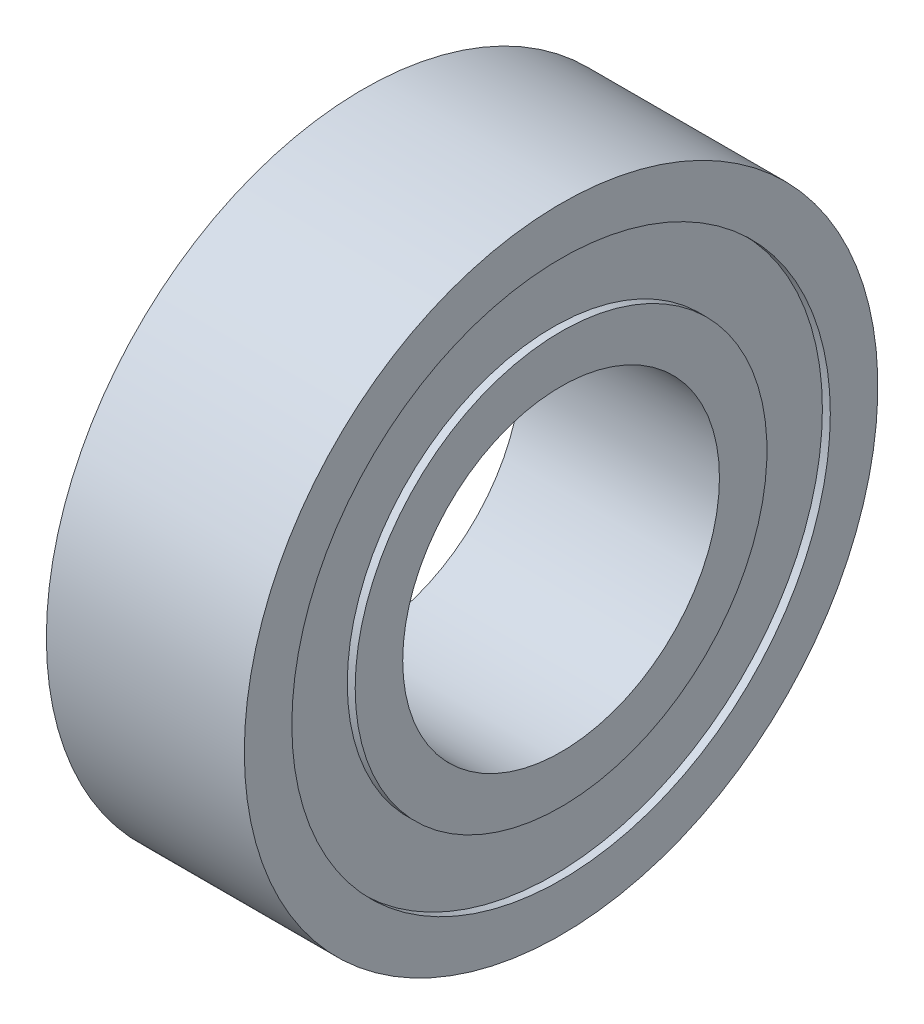
ISO-10303-21;
HEADER;
FILE_DESCRIPTION(('STEP AP214'),'2;1');
FILE_NAME('part.step','',(''),(''),'','','');
FILE_SCHEMA(('AUTOMOTIVE_DESIGN { 1 0 10303 214 1 1 1 1 }'));
ENDSEC;
DATA;
#1=APPLICATION_CONTEXT('core data for automotive mechanical design processes');
#2=APPLICATION_PROTOCOL_DEFINITION('international standard','automotive_design',2000,#1);
#3=PRODUCT_CONTEXT('',#1,'mechanical');
#4=PRODUCT('Part','Part','',(#3));
#5=PRODUCT_RELATED_PRODUCT_CATEGORY('part','',(#4));
#6=PRODUCT_DEFINITION_FORMATION('','',#4);
#7=PRODUCT_DEFINITION_CONTEXT('part definition',#1,'design');
#8=PRODUCT_DEFINITION('design','',#6,#7);
#9=PRODUCT_DEFINITION_SHAPE('','',#8);
#10=(LENGTH_UNIT() NAMED_UNIT(*) SI_UNIT(.MILLI.,.METRE.));
#11=(NAMED_UNIT(*) PLANE_ANGLE_UNIT() SI_UNIT($,.RADIAN.));
#12=(NAMED_UNIT(*) SI_UNIT($,.STERADIAN.) SOLID_ANGLE_UNIT());
#13=UNCERTAINTY_MEASURE_WITH_UNIT(LENGTH_MEASURE(1.E-05),#10,'distance_accuracy_value','');
#14=(GEOMETRIC_REPRESENTATION_CONTEXT(3) GLOBAL_UNCERTAINTY_ASSIGNED_CONTEXT((#13)) GLOBAL_UNIT_ASSIGNED_CONTEXT((#10,
#11,#12)) REPRESENTATION_CONTEXT('',''));
#15=CARTESIAN_POINT('',(0.,0.,0.));
#16=DIRECTION('',(0.,0.,1.));
#17=DIRECTION('',(1.,0.,0.));
#18=AXIS2_PLACEMENT_3D('',#15,#16,#17);
#19=CARTESIAN_POINT('',(-2.3,5.2,0.));
#20=DIRECTION('',(1.,0.,0.));
#21=DIRECTION('',(0.,1.,0.));
#22=AXIS2_PLACEMENT_3D('',#19,#20,#21);
#23=PLANE('',#22);
#24=CARTESIAN_POINT('',(-2.3,0.,0.));
#25=DIRECTION('',(-1.,0.,0.));
#26=DIRECTION('',(0.,0.,1.));
#27=AXIS2_PLACEMENT_3D('',#24,#25,#26);
#28=CIRCLE('',#27,5.2);
#29=CARTESIAN_POINT('',(-2.3,0.,5.2));
#30=VERTEX_POINT('',#29);
#31=EDGE_CURVE('E71',#30,#30,#28,.T.);
#32=ORIENTED_EDGE('',*,*,#31,.F.);
#33=EDGE_LOOP('',(#32));
#34=FACE_BOUND('',#33,.T.);
#35=CARTESIAN_POINT('',(-2.3,0.,0.));
#36=DIRECTION('',(-1.,0.,0.));
#37=DIRECTION('',(0.,0.,1.));
#38=AXIS2_PLACEMENT_3D('',#35,#36,#37);
#39=CIRCLE('',#38,6.8);
#40=CARTESIAN_POINT('',(-2.3,0.,6.8));
#41=VERTEX_POINT('',#40);
#42=EDGE_CURVE('E59',#41,#41,#39,.T.);
#43=ORIENTED_EDGE('',*,*,#42,.T.);
#44=EDGE_LOOP('',(#43));
#45=FACE_BOUND('',#44,.T.);
#46=ADVANCED_FACE('F14',(#34,#45),#23,.F.);
#47=CARTESIAN_POINT('',(-2.5,8.,0.));
#48=DIRECTION('',(1.,0.,0.));
#49=DIRECTION('',(0.,1.,0.));
#50=AXIS2_PLACEMENT_3D('',#47,#48,#49);
#51=PLANE('',#50);
#52=CARTESIAN_POINT('',(-2.5,0.,0.));
#53=DIRECTION('',(-1.,0.,0.));
#54=DIRECTION('',(0.,0.,1.));
#55=AXIS2_PLACEMENT_3D('',#52,#53,#54);
#56=CIRCLE('',#55,6.8);
#57=CARTESIAN_POINT('',(-2.5,0.,6.8));
#58=VERTEX_POINT('',#57);
#59=EDGE_CURVE('E49',#58,#58,#56,.T.);
#60=ORIENTED_EDGE('',*,*,#59,.F.);
#61=EDGE_LOOP('',(#60));
#62=FACE_BOUND('',#61,.T.);
#63=CARTESIAN_POINT('',(-2.5,0.,0.));
#64=DIRECTION('',(-1.,0.,0.));
#65=DIRECTION('',(0.,0.,1.));
#66=AXIS2_PLACEMENT_3D('',#63,#64,#65);
#67=CIRCLE('',#66,8.);
#68=CARTESIAN_POINT('',(-2.5,0.,8.));
#69=VERTEX_POINT('',#68);
#70=EDGE_CURVE('E47',#69,#69,#67,.T.);
#71=ORIENTED_EDGE('',*,*,#70,.T.);
#72=EDGE_LOOP('',(#71));
#73=FACE_BOUND('',#72,.T.);
#74=ADVANCED_FACE('F16',(#62,#73),#51,.F.);
#75=CARTESIAN_POINT('',(2.5,6.8,0.));
#76=DIRECTION('',(-1.,0.,0.));
#77=DIRECTION('',(0.,0.,1.));
#78=AXIS2_PLACEMENT_3D('',#75,#76,#77);
#79=PLANE('',#78);
#80=CARTESIAN_POINT('',(2.5,0.,0.));
#81=DIRECTION('',(-1.,0.,0.));
#82=DIRECTION('',(0.,0.,1.));
#83=AXIS2_PLACEMENT_3D('',#80,#81,#82);
#84=CIRCLE('',#83,6.8);
#85=CARTESIAN_POINT('',(2.5,0.,6.8));
#86=VERTEX_POINT('',#85);
#87=EDGE_CURVE('E53',#86,#86,#84,.T.);
#88=ORIENTED_EDGE('',*,*,#87,.T.);
#89=EDGE_LOOP('',(#88));
#90=FACE_BOUND('',#89,.T.);
#91=CARTESIAN_POINT('',(2.5,0.,0.));
#92=DIRECTION('',(-1.,0.,0.));
#93=DIRECTION('',(0.,0.,1.));
#94=AXIS2_PLACEMENT_3D('',#91,#92,#93);
#95=CIRCLE('',#94,8.);
#96=CARTESIAN_POINT('',(2.5,0.,8.));
#97=VERTEX_POINT('',#96);
#98=EDGE_CURVE('E44',#97,#97,#95,.T.);
#99=ORIENTED_EDGE('',*,*,#98,.F.);
#100=EDGE_LOOP('',(#99));
#101=FACE_BOUND('',#100,.T.);
#102=ADVANCED_FACE('F119',(#90,#101),#79,.F.);
#103=CARTESIAN_POINT('',(2.3,6.8,0.));
#104=DIRECTION('',(-1.,0.,0.));
#105=DIRECTION('',(0.,0.,1.));
#106=AXIS2_PLACEMENT_3D('',#103,#104,#105);
#107=PLANE('',#106);
#108=CARTESIAN_POINT('',(2.3,0.,0.));
#109=DIRECTION('',(-1.,0.,0.));
#110=DIRECTION('',(0.,0.,1.));
#111=AXIS2_PLACEMENT_3D('',#108,#109,#110);
#112=CIRCLE('',#111,5.2);
#113=CARTESIAN_POINT('',(2.3,0.,5.2));
#114=VERTEX_POINT('',#113);
#115=EDGE_CURVE('E33',#114,#114,#112,.T.);
#116=ORIENTED_EDGE('',*,*,#115,.T.);
#117=EDGE_LOOP('',(#116));
#118=FACE_BOUND('',#117,.T.);
#119=CARTESIAN_POINT('',(2.3,0.,0.));
#120=DIRECTION('',(-1.,0.,0.));
#121=DIRECTION('',(0.,0.,1.));
#122=AXIS2_PLACEMENT_3D('',#119,#120,#121);
#123=CIRCLE('',#122,6.8);
#124=CARTESIAN_POINT('',(2.3,0.,6.8));
#125=VERTEX_POINT('',#124);
#126=EDGE_CURVE('E42',#125,#125,#123,.T.);
#127=ORIENTED_EDGE('',*,*,#126,.F.);
#128=EDGE_LOOP('',(#127));
#129=FACE_BOUND('',#128,.T.);
#130=ADVANCED_FACE('F120',(#118,#129),#107,.F.);
#131=CARTESIAN_POINT('',(2.5,4.,0.));
#132=DIRECTION('',(-1.,0.,0.));
#133=DIRECTION('',(0.,0.,1.));
#134=AXIS2_PLACEMENT_3D('',#131,#132,#133);
#135=PLANE('',#134);
#136=CARTESIAN_POINT('',(2.5,0.,0.));
#137=DIRECTION('',(-1.,0.,0.));
#138=DIRECTION('',(0.,0.,1.));
#139=AXIS2_PLACEMENT_3D('',#136,#137,#138);
#140=CIRCLE('',#139,4.);
#141=CARTESIAN_POINT('',(2.5,0.,4.));
#142=VERTEX_POINT('',#141);
#143=EDGE_CURVE('E22',#142,#142,#140,.T.);
#144=ORIENTED_EDGE('',*,*,#143,.T.);
#145=EDGE_LOOP('',(#144));
#146=FACE_BOUND('',#145,.T.);
#147=CARTESIAN_POINT('',(2.5,0.,0.));
#148=DIRECTION('',(-1.,0.,0.));
#149=DIRECTION('',(0.,0.,1.));
#150=AXIS2_PLACEMENT_3D('',#147,#148,#149);
#151=CIRCLE('',#150,5.2);
#152=CARTESIAN_POINT('',(2.5,0.,5.2));
#153=VERTEX_POINT('',#152);
#154=EDGE_CURVE('E36',#153,#153,#151,.T.);
#155=ORIENTED_EDGE('',*,*,#154,.F.);
#156=EDGE_LOOP('',(#155));
#157=FACE_BOUND('',#156,.T.);
#158=ADVANCED_FACE('F103',(#146,#157),#135,.F.);
#159=CARTESIAN_POINT('',(-2.5,5.2,0.));
#160=DIRECTION('',(1.,0.,0.));
#161=DIRECTION('',(0.,1.,0.));
#162=AXIS2_PLACEMENT_3D('',#159,#160,#161);
#163=PLANE('',#162);
#164=CARTESIAN_POINT('',(-2.5,0.,0.));
#165=DIRECTION('',(-1.,0.,0.));
#166=DIRECTION('',(0.,0.,1.));
#167=AXIS2_PLACEMENT_3D('',#164,#165,#166);
#168=CIRCLE('',#167,4.);
#169=CARTESIAN_POINT('',(-2.5,0.,4.));
#170=VERTEX_POINT('',#169);
#171=EDGE_CURVE('E10',#170,#170,#168,.T.);
#172=ORIENTED_EDGE('',*,*,#171,.F.);
#173=EDGE_LOOP('',(#172));
#174=FACE_BOUND('',#173,.T.);
#175=CARTESIAN_POINT('',(-2.5,0.,0.));
#176=DIRECTION('',(-1.,0.,0.));
#177=DIRECTION('',(0.,0.,1.));
#178=AXIS2_PLACEMENT_3D('',#175,#176,#177);
#179=CIRCLE('',#178,5.2);
#180=CARTESIAN_POINT('',(-2.5,0.,5.2));
#181=VERTEX_POINT('',#180);
#182=EDGE_CURVE('E62',#181,#181,#179,.T.);
#183=ORIENTED_EDGE('',*,*,#182,.T.);
#184=EDGE_LOOP('',(#183));
#185=FACE_BOUND('',#184,.T.);
#186=ADVANCED_FACE('F110',(#174,#185),#163,.F.);
#187=CARTESIAN_POINT('',(0.,0.,0.));
#188=DIRECTION('',(-1.,0.,0.));
#189=DIRECTION('',(0.,0.,1.));
#190=AXIS2_PLACEMENT_3D('',#187,#188,#189);
#191=CYLINDRICAL_SURFACE('',#190,4.);
#192=ORIENTED_EDGE('',*,*,#171,.T.);
#193=EDGE_LOOP('',(#192));
#194=FACE_BOUND('',#193,.T.);
#195=ORIENTED_EDGE('',*,*,#143,.F.);
#196=EDGE_LOOP('',(#195));
#197=FACE_BOUND('',#196,.T.);
#198=ADVANCED_FACE('F102',(#194,#197),#191,.F.);
#199=CARTESIAN_POINT('',(0.,0.,0.));
#200=DIRECTION('',(-1.,0.,0.));
#201=DIRECTION('',(0.,0.,1.));
#202=AXIS2_PLACEMENT_3D('',#199,#200,#201);
#203=CYLINDRICAL_SURFACE('',#202,5.2);
#204=ORIENTED_EDGE('',*,*,#115,.F.);
#205=EDGE_LOOP('',(#204));
#206=FACE_BOUND('',#205,.T.);
#207=ORIENTED_EDGE('',*,*,#154,.T.);
#208=EDGE_LOOP('',(#207));
#209=FACE_BOUND('',#208,.T.);
#210=ADVANCED_FACE('F106',(#206,#209),#203,.T.);
#211=CARTESIAN_POINT('',(0.,0.,0.));
#212=DIRECTION('',(-1.,0.,0.));
#213=DIRECTION('',(0.,0.,1.));
#214=AXIS2_PLACEMENT_3D('',#211,#212,#213);
#215=CYLINDRICAL_SURFACE('',#214,6.8);
#216=ORIENTED_EDGE('',*,*,#126,.T.);
#217=EDGE_LOOP('',(#216));
#218=FACE_BOUND('',#217,.T.);
#219=ORIENTED_EDGE('',*,*,#87,.F.);
#220=EDGE_LOOP('',(#219));
#221=FACE_BOUND('',#220,.T.);
#222=ADVANCED_FACE('F98',(#218,#221),#215,.F.);
#223=CARTESIAN_POINT('',(0.,0.,0.));
#224=DIRECTION('',(-1.,0.,0.));
#225=DIRECTION('',(0.,0.,1.));
#226=AXIS2_PLACEMENT_3D('',#223,#224,#225);
#227=CYLINDRICAL_SURFACE('',#226,8.);
#228=ORIENTED_EDGE('',*,*,#70,.F.);
#229=EDGE_LOOP('',(#228));
#230=FACE_BOUND('',#229,.T.);
#231=ORIENTED_EDGE('',*,*,#98,.T.);
#232=EDGE_LOOP('',(#231));
#233=FACE_BOUND('',#232,.T.);
#234=ADVANCED_FACE('F86',(#230,#233),#227,.T.);
#235=CARTESIAN_POINT('',(0.,0.,0.));
#236=DIRECTION('',(-1.,0.,0.));
#237=DIRECTION('',(0.,0.,1.));
#238=AXIS2_PLACEMENT_3D('',#235,#236,#237);
#239=CYLINDRICAL_SURFACE('',#238,6.8);
#240=ORIENTED_EDGE('',*,*,#59,.T.);
#241=EDGE_LOOP('',(#240));
#242=FACE_BOUND('',#241,.T.);
#243=ORIENTED_EDGE('',*,*,#42,.F.);
#244=EDGE_LOOP('',(#243));
#245=FACE_BOUND('',#244,.T.);
#246=ADVANCED_FACE('F88',(#242,#245),#239,.F.);
#247=CARTESIAN_POINT('',(0.,0.,0.));
#248=DIRECTION('',(-1.,0.,0.));
#249=DIRECTION('',(0.,0.,1.));
#250=AXIS2_PLACEMENT_3D('',#247,#248,#249);
#251=CYLINDRICAL_SURFACE('',#250,5.2);
#252=ORIENTED_EDGE('',*,*,#182,.F.);
#253=EDGE_LOOP('',(#252));
#254=FACE_BOUND('',#253,.T.);
#255=ORIENTED_EDGE('',*,*,#31,.T.);
#256=EDGE_LOOP('',(#255));
#257=FACE_BOUND('',#256,.T.);
#258=ADVANCED_FACE('F78',(#254,#257),#251,.T.);
#259=CLOSED_SHELL('',(#46,#74,#102,#130,#158,#186,#198,#210,#222,#234,#246,#258));
#260=MANIFOLD_SOLID_BREP('B1',#259);
#261=ADVANCED_BREP_SHAPE_REPRESENTATION('',(#18,#260),#14);
#262=SHAPE_DEFINITION_REPRESENTATION(#9,#261);
ENDSEC;
END-ISO-10303-21;
